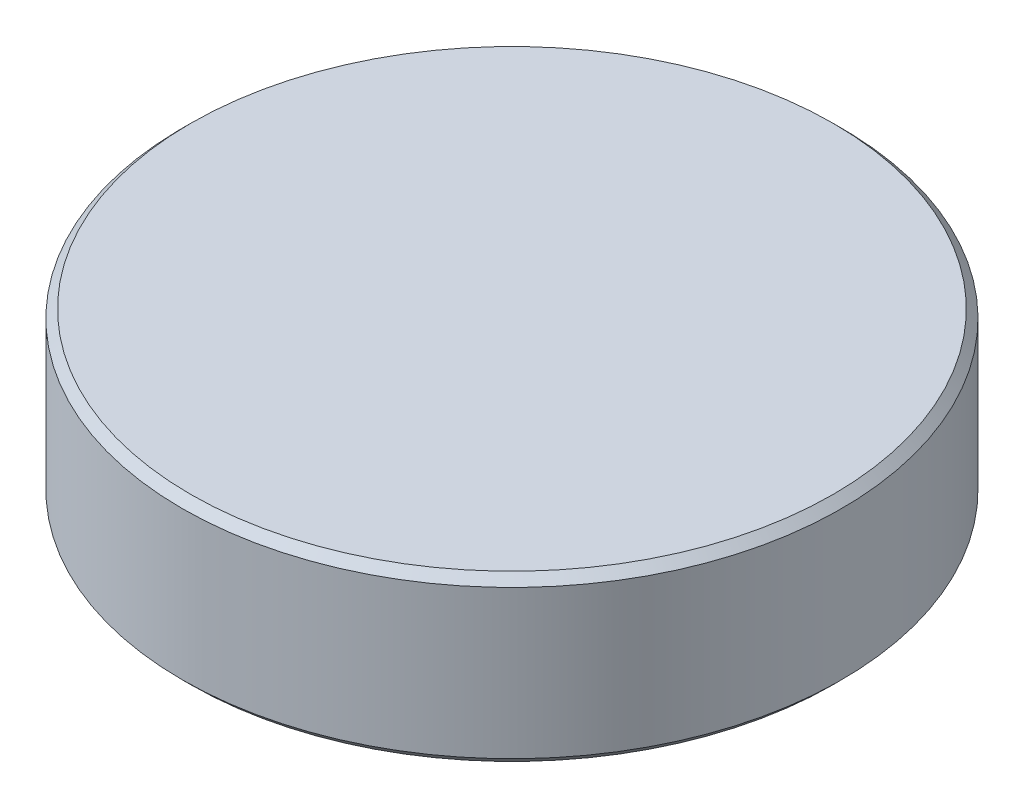
ISO-10303-21;
HEADER;
FILE_DESCRIPTION(('STEP AP214'),'2;1');
FILE_NAME('part.step','',(''),(''),'','','');
FILE_SCHEMA(('AUTOMOTIVE_DESIGN { 1 0 10303 214 1 1 1 1 }'));
ENDSEC;
DATA;
#1=APPLICATION_CONTEXT('core data for automotive mechanical design processes');
#2=APPLICATION_PROTOCOL_DEFINITION('international standard','automotive_design',2000,#1);
#3=PRODUCT_CONTEXT('',#1,'mechanical');
#4=PRODUCT('Part','Part','',(#3));
#5=PRODUCT_RELATED_PRODUCT_CATEGORY('part','',(#4));
#6=PRODUCT_DEFINITION_FORMATION('','',#4);
#7=PRODUCT_DEFINITION_CONTEXT('part definition',#1,'design');
#8=PRODUCT_DEFINITION('design','',#6,#7);
#9=PRODUCT_DEFINITION_SHAPE('','',#8);
#10=(LENGTH_UNIT() NAMED_UNIT(*) SI_UNIT(.MILLI.,.METRE.));
#11=(NAMED_UNIT(*) PLANE_ANGLE_UNIT() SI_UNIT($,.RADIAN.));
#12=(NAMED_UNIT(*) SI_UNIT($,.STERADIAN.) SOLID_ANGLE_UNIT());
#13=UNCERTAINTY_MEASURE_WITH_UNIT(LENGTH_MEASURE(1.E-05),#10,'distance_accuracy_value','');
#14=(GEOMETRIC_REPRESENTATION_CONTEXT(3) GLOBAL_UNCERTAINTY_ASSIGNED_CONTEXT((#13)) GLOBAL_UNIT_ASSIGNED_CONTEXT((#10,
#11,#12)) REPRESENTATION_CONTEXT('',''));
#15=CARTESIAN_POINT('',(0.,0.,0.));
#16=DIRECTION('',(0.,0.,1.));
#17=DIRECTION('',(1.,0.,0.));
#18=AXIS2_PLACEMENT_3D('',#15,#16,#17);
#19=CARTESIAN_POINT('',(0.,50.,0.));
#20=DIRECTION('',(0.,-1.,0.));
#21=DIRECTION('',(0.,0.,-1.));
#22=AXIS2_PLACEMENT_3D('',#19,#20,#21);
#23=CYLINDRICAL_SURFACE('',#22,100.);
#24=CARTESIAN_POINT('',(0.,2.5,0.));
#25=DIRECTION('',(0.,1.,0.));
#26=DIRECTION('',(0.,0.,1.));
#27=AXIS2_PLACEMENT_3D('',#24,#25,#26);
#28=CIRCLE('',#27,100.);
#29=CARTESIAN_POINT('',(0.,2.5,100.));
#30=VERTEX_POINT('',#29);
#31=EDGE_CURVE('E40',#30,#30,#28,.T.);
#32=ORIENTED_EDGE('',*,*,#31,.T.);
#33=EDGE_LOOP('',(#32));
#34=FACE_BOUND('',#33,.T.);
#35=CARTESIAN_POINT('',(0.,47.4999999999999,0.));
#36=DIRECTION('',(0.,1.,0.));
#37=DIRECTION('',(0.,0.,1.));
#38=AXIS2_PLACEMENT_3D('',#35,#36,#37);
#39=CIRCLE('',#38,100.);
#40=CARTESIAN_POINT('',(0.,47.4999999999999,100.));
#41=VERTEX_POINT('',#40);
#42=EDGE_CURVE('E44',#41,#41,#39,.F.);
#43=ORIENTED_EDGE('',*,*,#42,.T.);
#44=EDGE_LOOP('',(#43));
#45=FACE_BOUND('',#44,.T.);
#46=ADVANCED_FACE('F29',(#34,#45),#23,.T.);
#47=CARTESIAN_POINT('',(0.,50.,0.));
#48=DIRECTION('',(0.,1.,0.));
#49=DIRECTION('',(0.,0.,1.));
#50=AXIS2_PLACEMENT_3D('',#47,#48,#49);
#51=PLANE('',#50);
#52=CARTESIAN_POINT('',(0.,50.,0.));
#53=DIRECTION('',(0.,1.,0.));
#54=DIRECTION('',(0.,0.,1.));
#55=AXIS2_PLACEMENT_3D('',#52,#53,#54);
#56=CIRCLE('',#55,97.4999999999999);
#57=CARTESIAN_POINT('',(0.,50.,97.4999999999999));
#58=VERTEX_POINT('',#57);
#59=EDGE_CURVE('E10',#58,#58,#56,.T.);
#60=ORIENTED_EDGE('',*,*,#59,.T.);
#61=EDGE_LOOP('',(#60));
#62=FACE_BOUND('',#61,.T.);
#63=ADVANCED_FACE('F60',(#62),#51,.T.);
#64=CARTESIAN_POINT('',(0.,0.,0.));
#65=DIRECTION('',(0.,1.,0.));
#66=DIRECTION('',(0.,0.,1.));
#67=AXIS2_PLACEMENT_3D('',#64,#65,#66);
#68=PLANE('',#67);
#69=CARTESIAN_POINT('',(0.,0.,0.));
#70=DIRECTION('',(0.,1.,0.));
#71=DIRECTION('',(0.,0.,1.));
#72=AXIS2_PLACEMENT_3D('',#69,#70,#71);
#73=CIRCLE('',#72,97.5);
#74=CARTESIAN_POINT('',(0.,0.,97.5));
#75=VERTEX_POINT('',#74);
#76=EDGE_CURVE('E36',#75,#75,#73,.F.);
#77=ORIENTED_EDGE('',*,*,#76,.T.);
#78=EDGE_LOOP('',(#77));
#79=FACE_BOUND('',#78,.T.);
#80=ADVANCED_FACE('F57',(#79),#68,.F.);
#81=CARTESIAN_POINT('',(0.,2.5,0.));
#82=DIRECTION('',(0.,1.,0.));
#83=DIRECTION('',(0.,0.,1.));
#84=AXIS2_PLACEMENT_3D('',#81,#82,#83);
#85=CONICAL_SURFACE('',#84,100.,0.785398163397451);
#86=ORIENTED_EDGE('',*,*,#76,.F.);
#87=EDGE_LOOP('',(#86));
#88=FACE_BOUND('',#87,.T.);
#89=ORIENTED_EDGE('',*,*,#31,.F.);
#90=EDGE_LOOP('',(#89));
#91=FACE_BOUND('',#90,.T.);
#92=ADVANCED_FACE('F53',(#88,#91),#85,.T.);
#93=CARTESIAN_POINT('',(0.,50.,0.));
#94=DIRECTION('',(0.,-1.,0.));
#95=DIRECTION('',(0.,0.,-1.));
#96=AXIS2_PLACEMENT_3D('',#93,#94,#95);
#97=CONICAL_SURFACE('',#96,97.4999999999999,0.785398163397451);
#98=ORIENTED_EDGE('',*,*,#42,.F.);
#99=EDGE_LOOP('',(#98));
#100=FACE_BOUND('',#99,.T.);
#101=ORIENTED_EDGE('',*,*,#59,.F.);
#102=EDGE_LOOP('',(#101));
#103=FACE_BOUND('',#102,.T.);
#104=ADVANCED_FACE('F31',(#100,#103),#97,.T.);
#105=CLOSED_SHELL('',(#46,#63,#80,#92,#104));
#106=MANIFOLD_SOLID_BREP('B2',#105);
#107=ADVANCED_BREP_SHAPE_REPRESENTATION('',(#18,#106),#14);
#108=SHAPE_DEFINITION_REPRESENTATION(#9,#107);
ENDSEC;
END-ISO-10303-21;
